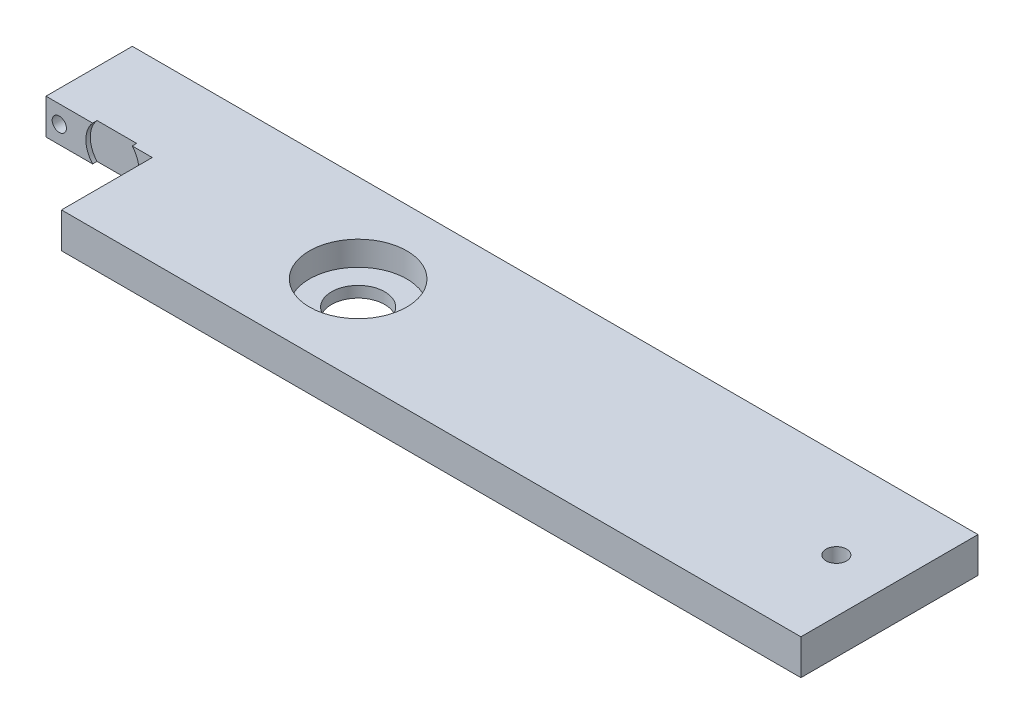
ISO-10303-21;
HEADER;
FILE_DESCRIPTION(('STEP AP214'),'2;1');
FILE_NAME('part.step','',(''),(''),'','','');
FILE_SCHEMA(('AUTOMOTIVE_DESIGN { 1 0 10303 214 1 1 1 1 }'));
ENDSEC;
DATA;
#1=APPLICATION_CONTEXT('core data for automotive mechanical design processes');
#2=APPLICATION_PROTOCOL_DEFINITION('international standard','automotive_design',2000,#1);
#3=PRODUCT_CONTEXT('',#1,'mechanical');
#4=PRODUCT('Part','Part','',(#3));
#5=PRODUCT_RELATED_PRODUCT_CATEGORY('part','',(#4));
#6=PRODUCT_DEFINITION_FORMATION('','',#4);
#7=PRODUCT_DEFINITION_CONTEXT('part definition',#1,'design');
#8=PRODUCT_DEFINITION('design','',#6,#7);
#9=PRODUCT_DEFINITION_SHAPE('','',#8);
#10=(LENGTH_UNIT() NAMED_UNIT(*) SI_UNIT(.MILLI.,.METRE.));
#11=(NAMED_UNIT(*) PLANE_ANGLE_UNIT() SI_UNIT($,.RADIAN.));
#12=(NAMED_UNIT(*) SI_UNIT($,.STERADIAN.) SOLID_ANGLE_UNIT());
#13=UNCERTAINTY_MEASURE_WITH_UNIT(LENGTH_MEASURE(1.E-05),#10,'distance_accuracy_value','');
#14=(GEOMETRIC_REPRESENTATION_CONTEXT(3) GLOBAL_UNCERTAINTY_ASSIGNED_CONTEXT((#13)) GLOBAL_UNIT_ASSIGNED_CONTEXT((#10,
#11,#12)) REPRESENTATION_CONTEXT('',''));
#15=CARTESIAN_POINT('',(0.,0.,0.));
#16=DIRECTION('',(0.,0.,1.));
#17=DIRECTION('',(1.,0.,0.));
#18=AXIS2_PLACEMENT_3D('',#15,#16,#17);
#19=CARTESIAN_POINT('',(-74.6124999999999,12.7,-0.79375));
#20=DIRECTION('',(0.,0.,-1.));
#21=DIRECTION('',(-1.,0.,0.));
#22=AXIS2_PLACEMENT_3D('',#19,#20,#21);
#23=PLANE('',#22);
#24=DIRECTION('',(1.,0.,0.));
#25=VECTOR('',#24,1.);
#26=CARTESIAN_POINT('',(-112.7125,12.7,-0.79375));
#27=LINE('',#26,#25);
#28=CARTESIAN_POINT('',(-81.800484171438,12.7,-0.79375));
#29=VERTEX_POINT('',#28);
#30=CARTESIAN_POINT('',(-74.6124999999999,12.7,-0.79375));
#31=VERTEX_POINT('',#30);
#32=EDGE_CURVE('E107',#29,#31,#27,.T.);
#33=ORIENTED_EDGE('',*,*,#32,.F.);
#34=CARTESIAN_POINT('',(-88.8999999999999,6.35,-0.79375));
#35=DIRECTION('',(0.,0.,1.));
#36=DIRECTION('',(1.,0.,0.));
#37=AXIS2_PLACEMENT_3D('',#34,#35,#36);
#38=CIRCLE('',#37,9.52500000000001);
#39=CARTESIAN_POINT('',(-81.800484171438,0.,-0.79375));
#40=VERTEX_POINT('',#39);
#41=EDGE_CURVE('E177',#40,#29,#38,.T.);
#42=ORIENTED_EDGE('',*,*,#41,.F.);
#43=DIRECTION('',(1.,0.,0.));
#44=VECTOR('',#43,1.);
#45=CARTESIAN_POINT('',(-74.6124999999999,0.,-0.79375));
#46=LINE('',#45,#44);
#47=CARTESIAN_POINT('',(-74.6124999999999,0.,-0.79375));
#48=VERTEX_POINT('',#47);
#49=EDGE_CURVE('E127',#40,#48,#46,.T.);
#50=ORIENTED_EDGE('',*,*,#49,.T.);
#51=DIRECTION('',(0.,-1.,0.));
#52=VECTOR('',#51,1.);
#53=CARTESIAN_POINT('',(-74.6124999999999,12.7,-0.79375));
#54=LINE('',#53,#52);
#55=EDGE_CURVE('E125',#31,#48,#54,.T.);
#56=ORIENTED_EDGE('',*,*,#55,.F.);
#57=EDGE_LOOP('',(#33,#42,#50,#56));
#58=FACE_BOUND('',#57,.T.);
#59=ADVANCED_FACE('F37',(#58),#23,.F.);
#60=CARTESIAN_POINT('',(190.5,12.7,-31.75));
#61=DIRECTION('',(-1.,0.,0.));
#62=DIRECTION('',(0.,0.,1.));
#63=AXIS2_PLACEMENT_3D('',#60,#61,#62);
#64=PLANE('',#63);
#65=DIRECTION('',(0.,0.,-1.));
#66=VECTOR('',#65,1.);
#67=CARTESIAN_POINT('',(190.5,0.,-31.75));
#68=LINE('',#67,#66);
#69=CARTESIAN_POINT('',(190.5,0.,31.75));
#70=VERTEX_POINT('',#69);
#71=CARTESIAN_POINT('',(190.5,0.,-31.75));
#72=VERTEX_POINT('',#71);
#73=EDGE_CURVE('E140',#70,#72,#68,.T.);
#74=ORIENTED_EDGE('',*,*,#73,.T.);
#75=DIRECTION('',(0.,-1.,0.));
#76=VECTOR('',#75,1.);
#77=CARTESIAN_POINT('',(190.5,12.7,-31.75));
#78=LINE('',#77,#76);
#79=CARTESIAN_POINT('',(190.5,12.7,-31.75));
#80=VERTEX_POINT('',#79);
#81=EDGE_CURVE('E163',#80,#72,#78,.T.);
#82=ORIENTED_EDGE('',*,*,#81,.F.);
#83=DIRECTION('',(0.,0.,-1.));
#84=VECTOR('',#83,1.);
#85=CARTESIAN_POINT('',(190.5,12.7,-31.75));
#86=LINE('',#85,#84);
#87=CARTESIAN_POINT('',(190.5,12.7,31.75));
#88=VERTEX_POINT('',#87);
#89=EDGE_CURVE('E155',#88,#80,#86,.T.);
#90=ORIENTED_EDGE('',*,*,#89,.F.);
#91=DIRECTION('',(0.,-1.,0.));
#92=VECTOR('',#91,1.);
#93=CARTESIAN_POINT('',(190.5,12.7,31.75));
#94=LINE('',#93,#92);
#95=EDGE_CURVE('E135',#88,#70,#94,.T.);
#96=ORIENTED_EDGE('',*,*,#95,.T.);
#97=EDGE_LOOP('',(#74,#82,#90,#96));
#98=FACE_BOUND('',#97,.T.);
#99=ADVANCED_FACE('F39',(#98),#64,.F.);
#100=CARTESIAN_POINT('',(-112.7125,12.7,-31.75));
#101=DIRECTION('',(0.,0.,1.));
#102=DIRECTION('',(1.,0.,0.));
#103=AXIS2_PLACEMENT_3D('',#100,#101,#102);
#104=PLANE('',#103);
#105=CARTESIAN_POINT('',(-107.95,6.35,-31.75));
#106=DIRECTION('',(0.,0.,-1.));
#107=DIRECTION('',(-1.,0.,0.));
#108=AXIS2_PLACEMENT_3D('',#105,#106,#107);
#109=CIRCLE('',#108,2.55269999999999);
#110=CARTESIAN_POINT('',(-110.5027,6.35,-31.75));
#111=VERTEX_POINT('',#110);
#112=EDGE_CURVE('E199',#111,#111,#109,.T.);
#113=ORIENTED_EDGE('',*,*,#112,.F.);
#114=EDGE_LOOP('',(#113));
#115=FACE_BOUND('',#114,.T.);
#116=DIRECTION('',(-1.,0.,0.));
#117=VECTOR('',#116,1.);
#118=CARTESIAN_POINT('',(-112.7125,0.,-31.75));
#119=LINE('',#118,#117);
#120=CARTESIAN_POINT('',(-112.7125,0.,-31.75));
#121=VERTEX_POINT('',#120);
#122=EDGE_CURVE('E143',#72,#121,#119,.T.);
#123=ORIENTED_EDGE('',*,*,#122,.T.);
#124=DIRECTION('',(0.,-1.,0.));
#125=VECTOR('',#124,1.);
#126=CARTESIAN_POINT('',(-112.7125,12.7,-31.75));
#127=LINE('',#126,#125);
#128=CARTESIAN_POINT('',(-112.7125,12.7,-31.75));
#129=VERTEX_POINT('',#128);
#130=EDGE_CURVE('E160',#129,#121,#127,.T.);
#131=ORIENTED_EDGE('',*,*,#130,.F.);
#132=DIRECTION('',(-1.,0.,0.));
#133=VECTOR('',#132,1.);
#134=CARTESIAN_POINT('',(-112.7125,12.7,-31.75));
#135=LINE('',#134,#133);
#136=EDGE_CURVE('E97',#80,#129,#135,.T.);
#137=ORIENTED_EDGE('',*,*,#136,.F.);
#138=ORIENTED_EDGE('',*,*,#81,.T.);
#139=EDGE_LOOP('',(#123,#131,#137,#138));
#140=FACE_BOUND('',#139,.T.);
#141=ADVANCED_FACE('F233',(#115,#140),#104,.F.);
#142=CARTESIAN_POINT('',(-112.7125,12.7,-31.75));
#143=DIRECTION('',(1.,0.,0.));
#144=DIRECTION('',(0.,0.,-1.));
#145=AXIS2_PLACEMENT_3D('',#142,#143,#144);
#146=PLANE('',#145);
#147=DIRECTION('',(0.,0.,1.));
#148=VECTOR('',#147,1.);
#149=CARTESIAN_POINT('',(-112.7125,0.,-31.75));
#150=LINE('',#149,#148);
#151=CARTESIAN_POINT('',(-112.7125,0.,-0.79375));
#152=VERTEX_POINT('',#151);
#153=EDGE_CURVE('E146',#121,#152,#150,.T.);
#154=ORIENTED_EDGE('',*,*,#153,.T.);
#155=DIRECTION('',(0.,-1.,0.));
#156=VECTOR('',#155,1.);
#157=CARTESIAN_POINT('',(-112.7125,12.7,-0.79375));
#158=LINE('',#157,#156);
#159=CARTESIAN_POINT('',(-112.7125,12.7,-0.79375));
#160=VERTEX_POINT('',#159);
#161=EDGE_CURVE('E130',#160,#152,#158,.T.);
#162=ORIENTED_EDGE('',*,*,#161,.F.);
#163=DIRECTION('',(0.,0.,1.));
#164=VECTOR('',#163,1.);
#165=CARTESIAN_POINT('',(-112.7125,12.7,-31.75));
#166=LINE('',#165,#164);
#167=EDGE_CURVE('E122',#129,#160,#166,.T.);
#168=ORIENTED_EDGE('',*,*,#167,.F.);
#169=ORIENTED_EDGE('',*,*,#130,.T.);
#170=EDGE_LOOP('',(#154,#162,#168,#169));
#171=FACE_BOUND('',#170,.T.);
#172=ADVANCED_FACE('F222',(#171),#146,.F.);
#173=CARTESIAN_POINT('',(-107.95,6.35,-0.793749999999999));
#174=DIRECTION('',(0.,0.,-1.));
#175=DIRECTION('',(-1.,0.,0.));
#176=AXIS2_PLACEMENT_3D('',#173,#174,#175);
#177=CIRCLE('',#176,2.55269999999999);
#178=CARTESIAN_POINT('',(-110.5027,6.35,-0.793749999999999));
#179=VERTEX_POINT('',#178);
#180=EDGE_CURVE('E202',#179,#179,#177,.T.);
#181=ORIENTED_EDGE('',*,*,#180,.T.);
#182=EDGE_LOOP('',(#181));
#183=FACE_BOUND('',#182,.T.);
#184=CARTESIAN_POINT('',(-95.9995158285617,0.,-0.79375));
#185=VERTEX_POINT('',#184);
#186=EDGE_CURVE('E149',#152,#185,#46,.T.);
#187=ORIENTED_EDGE('',*,*,#186,.T.);
#188=CARTESIAN_POINT('',(-95.9995158285617,12.7,-0.79375));
#189=VERTEX_POINT('',#188);
#190=EDGE_CURVE('E183',#189,#185,#38,.T.);
#191=ORIENTED_EDGE('',*,*,#190,.F.);
#192=EDGE_CURVE('E121',#160,#189,#27,.T.);
#193=ORIENTED_EDGE('',*,*,#192,.F.);
#194=ORIENTED_EDGE('',*,*,#161,.T.);
#195=EDGE_LOOP('',(#187,#191,#193,#194));
#196=FACE_BOUND('',#195,.T.);
#197=ADVANCED_FACE('F226',(#183,#196),#23,.F.);
#198=CARTESIAN_POINT('',(-74.6124999999999,12.7,31.75));
#199=DIRECTION('',(1.,0.,0.));
#200=DIRECTION('',(0.,0.,-1.));
#201=AXIS2_PLACEMENT_3D('',#198,#199,#200);
#202=PLANE('',#201);
#203=DIRECTION('',(0.,0.,1.));
#204=VECTOR('',#203,1.);
#205=CARTESIAN_POINT('',(-74.6124999999999,0.,31.75));
#206=LINE('',#205,#204);
#207=CARTESIAN_POINT('',(-74.6124999999999,0.,31.75));
#208=VERTEX_POINT('',#207);
#209=EDGE_CURVE('E152',#48,#208,#206,.T.);
#210=ORIENTED_EDGE('',*,*,#209,.T.);
#211=DIRECTION('',(0.,-1.,0.));
#212=VECTOR('',#211,1.);
#213=CARTESIAN_POINT('',(-74.6124999999999,12.7,31.75));
#214=LINE('',#213,#212);
#215=CARTESIAN_POINT('',(-74.6124999999999,12.7,31.75));
#216=VERTEX_POINT('',#215);
#217=EDGE_CURVE('E131',#216,#208,#214,.T.);
#218=ORIENTED_EDGE('',*,*,#217,.F.);
#219=DIRECTION('',(0.,0.,1.));
#220=VECTOR('',#219,1.);
#221=CARTESIAN_POINT('',(-74.6124999999999,12.7,31.75));
#222=LINE('',#221,#220);
#223=EDGE_CURVE('E113',#31,#216,#222,.T.);
#224=ORIENTED_EDGE('',*,*,#223,.F.);
#225=ORIENTED_EDGE('',*,*,#55,.T.);
#226=EDGE_LOOP('',(#210,#218,#224,#225));
#227=FACE_BOUND('',#226,.T.);
#228=ADVANCED_FACE('F133',(#227),#202,.F.);
#229=CARTESIAN_POINT('',(-74.6124999999999,12.7,31.75));
#230=DIRECTION('',(0.,0.,-1.));
#231=DIRECTION('',(-1.,0.,0.));
#232=AXIS2_PLACEMENT_3D('',#229,#230,#231);
#233=PLANE('',#232);
#234=DIRECTION('',(1.,0.,0.));
#235=VECTOR('',#234,1.);
#236=CARTESIAN_POINT('',(-74.6124999999999,0.,31.75));
#237=LINE('',#236,#235);
#238=EDGE_CURVE('E88',#208,#70,#237,.T.);
#239=ORIENTED_EDGE('',*,*,#238,.T.);
#240=ORIENTED_EDGE('',*,*,#95,.F.);
#241=DIRECTION('',(1.,0.,0.));
#242=VECTOR('',#241,1.);
#243=CARTESIAN_POINT('',(-74.6124999999999,12.7,31.75));
#244=LINE('',#243,#242);
#245=EDGE_CURVE('E61',#216,#88,#244,.T.);
#246=ORIENTED_EDGE('',*,*,#245,.F.);
#247=ORIENTED_EDGE('',*,*,#217,.T.);
#248=EDGE_LOOP('',(#239,#240,#246,#247));
#249=FACE_BOUND('',#248,.T.);
#250=ADVANCED_FACE('F236',(#249),#233,.F.);
#251=CARTESIAN_POINT('',(190.5,12.7,31.75));
#252=DIRECTION('',(0.,1.,0.));
#253=DIRECTION('',(0.,0.,1.));
#254=AXIS2_PLACEMENT_3D('',#251,#252,#253);
#255=PLANE('',#254);
#256=DIRECTION('',(0.,0.,1.));
#257=VECTOR('',#256,1.);
#258=CARTESIAN_POINT('',(-95.9995158285617,12.7,-2.38125));
#259=LINE('',#258,#257);
#260=CARTESIAN_POINT('',(-95.9995158285617,12.7,-2.38125));
#261=VERTEX_POINT('',#260);
#262=EDGE_CURVE('E196',#261,#189,#259,.T.);
#263=ORIENTED_EDGE('',*,*,#262,.F.);
#264=DIRECTION('',(1.,0.,0.));
#265=VECTOR('',#264,1.);
#266=CARTESIAN_POINT('',(190.5,12.7,-2.38125));
#267=LINE('',#266,#265);
#268=CARTESIAN_POINT('',(-81.800484171438,12.7,-2.38125));
#269=VERTEX_POINT('',#268);
#270=EDGE_CURVE('E193',#261,#269,#267,.T.);
#271=ORIENTED_EDGE('',*,*,#270,.T.);
#272=DIRECTION('',(0.,0.,1.));
#273=VECTOR('',#272,1.);
#274=CARTESIAN_POINT('',(-81.800484171438,12.7,-2.38125));
#275=LINE('',#274,#273);
#276=EDGE_CURVE('E118',#29,#269,#275,.F.);
#277=ORIENTED_EDGE('',*,*,#276,.F.);
#278=ORIENTED_EDGE('',*,*,#32,.T.);
#279=ORIENTED_EDGE('',*,*,#223,.T.);
#280=ORIENTED_EDGE('',*,*,#245,.T.);
#281=ORIENTED_EDGE('',*,*,#89,.T.);
#282=ORIENTED_EDGE('',*,*,#136,.T.);
#283=ORIENTED_EDGE('',*,*,#167,.T.);
#284=ORIENTED_EDGE('',*,*,#192,.T.);
#285=EDGE_LOOP('',(#263,#271,#277,#278,#279,#280,#281,#282,#283,#284));
#286=FACE_BOUND('',#285,.T.);
#287=CARTESIAN_POINT('',(171.45,12.7,0.));
#288=DIRECTION('',(0.,1.,0.));
#289=DIRECTION('',(0.,0.,1.));
#290=AXIS2_PLACEMENT_3D('',#287,#288,#289);
#291=CIRCLE('',#290,3.683);
#292=CARTESIAN_POINT('',(171.45,12.7,3.683));
#293=VERTEX_POINT('',#292);
#294=EDGE_CURVE('E205',#293,#293,#291,.T.);
#295=ORIENTED_EDGE('',*,*,#294,.F.);
#296=EDGE_LOOP('',(#295));
#297=FACE_BOUND('',#296,.T.);
#298=CARTESIAN_POINT('',(0.,12.7,0.));
#299=DIRECTION('',(0.,1.,0.));
#300=DIRECTION('',(0.,0.,1.));
#301=AXIS2_PLACEMENT_3D('',#298,#299,#300);
#302=CIRCLE('',#301,17.4625);
#303=CARTESIAN_POINT('',(0.,12.7,17.4625));
#304=VERTEX_POINT('',#303);
#305=EDGE_CURVE('E209',#304,#304,#302,.T.);
#306=ORIENTED_EDGE('',*,*,#305,.F.);
#307=EDGE_LOOP('',(#306));
#308=FACE_BOUND('',#307,.T.);
#309=ADVANCED_FACE('F110',(#286,#297,#308),#255,.T.);
#310=CARTESIAN_POINT('',(190.5,0.,31.75));
#311=DIRECTION('',(0.,1.,0.));
#312=DIRECTION('',(0.,0.,1.));
#313=AXIS2_PLACEMENT_3D('',#310,#311,#312);
#314=PLANE('',#313);
#315=CARTESIAN_POINT('',(0.,0.,0.));
#316=DIRECTION('',(0.,1.,0.));
#317=DIRECTION('',(0.,0.,1.));
#318=AXIS2_PLACEMENT_3D('',#315,#316,#317);
#319=CIRCLE('',#318,9.525);
#320=CARTESIAN_POINT('',(0.,0.,9.525));
#321=VERTEX_POINT('',#320);
#322=EDGE_CURVE('E184',#321,#321,#319,.T.);
#323=ORIENTED_EDGE('',*,*,#322,.T.);
#324=EDGE_LOOP('',(#323));
#325=FACE_BOUND('',#324,.T.);
#326=CARTESIAN_POINT('',(171.45,0.,0.));
#327=DIRECTION('',(0.,1.,0.));
#328=DIRECTION('',(0.,0.,1.));
#329=AXIS2_PLACEMENT_3D('',#326,#327,#328);
#330=CIRCLE('',#329,3.683);
#331=CARTESIAN_POINT('',(171.45,0.,3.683));
#332=VERTEX_POINT('',#331);
#333=EDGE_CURVE('E206',#332,#332,#330,.T.);
#334=ORIENTED_EDGE('',*,*,#333,.T.);
#335=EDGE_LOOP('',(#334));
#336=FACE_BOUND('',#335,.T.);
#337=DIRECTION('',(1.,0.,0.));
#338=VECTOR('',#337,1.);
#339=CARTESIAN_POINT('',(190.5,0.,-2.38125));
#340=LINE('',#339,#338);
#341=CARTESIAN_POINT('',(-95.9995158285617,0.,-2.38125));
#342=VERTEX_POINT('',#341);
#343=CARTESIAN_POINT('',(-81.800484171438,0.,-2.38125));
#344=VERTEX_POINT('',#343);
#345=EDGE_CURVE('E165',#342,#344,#340,.T.);
#346=ORIENTED_EDGE('',*,*,#345,.F.);
#347=DIRECTION('',(0.,0.,1.));
#348=VECTOR('',#347,1.);
#349=CARTESIAN_POINT('',(-95.9995158285617,0.,-2.38125));
#350=LINE('',#349,#348);
#351=EDGE_CURVE('E11',#342,#185,#350,.T.);
#352=ORIENTED_EDGE('',*,*,#351,.T.);
#353=ORIENTED_EDGE('',*,*,#186,.F.);
#354=ORIENTED_EDGE('',*,*,#153,.F.);
#355=ORIENTED_EDGE('',*,*,#122,.F.);
#356=ORIENTED_EDGE('',*,*,#73,.F.);
#357=ORIENTED_EDGE('',*,*,#238,.F.);
#358=ORIENTED_EDGE('',*,*,#209,.F.);
#359=ORIENTED_EDGE('',*,*,#49,.F.);
#360=DIRECTION('',(0.,0.,1.));
#361=VECTOR('',#360,1.);
#362=CARTESIAN_POINT('',(-81.800484171438,0.,-2.38125));
#363=LINE('',#362,#361);
#364=EDGE_CURVE('E45',#40,#344,#363,.F.);
#365=ORIENTED_EDGE('',*,*,#364,.T.);
#366=EDGE_LOOP('',(#346,#352,#353,#354,#355,#356,#357,#358,#359,#365));
#367=FACE_BOUND('',#366,.T.);
#368=ADVANCED_FACE('F170',(#325,#336,#367),#314,.F.);
#369=CARTESIAN_POINT('',(0.,3.96875,0.));
#370=DIRECTION('',(0.,1.,0.));
#371=DIRECTION('',(0.,0.,1.));
#372=AXIS2_PLACEMENT_3D('',#369,#370,#371);
#373=CYLINDRICAL_SURFACE('',#372,17.4625);
#374=CARTESIAN_POINT('',(0.,3.96875,0.));
#375=DIRECTION('',(0.,1.,0.));
#376=DIRECTION('',(0.,0.,1.));
#377=AXIS2_PLACEMENT_3D('',#374,#375,#376);
#378=CIRCLE('',#377,17.4625);
#379=CARTESIAN_POINT('',(0.,3.96875,17.4625));
#380=VERTEX_POINT('',#379);
#381=EDGE_CURVE('E144',#380,#380,#378,.T.);
#382=ORIENTED_EDGE('',*,*,#381,.F.);
#383=EDGE_LOOP('',(#382));
#384=FACE_BOUND('',#383,.T.);
#385=ORIENTED_EDGE('',*,*,#305,.T.);
#386=EDGE_LOOP('',(#385));
#387=FACE_BOUND('',#386,.T.);
#388=ADVANCED_FACE('F276',(#384,#387),#373,.F.);
#389=CARTESIAN_POINT('',(0.,3.96875,0.));
#390=DIRECTION('',(0.,1.,0.));
#391=DIRECTION('',(0.,0.,1.));
#392=AXIS2_PLACEMENT_3D('',#389,#390,#391);
#393=PLANE('',#392);
#394=CARTESIAN_POINT('',(0.,3.96875,0.));
#395=DIRECTION('',(0.,1.,0.));
#396=DIRECTION('',(0.,0.,1.));
#397=AXIS2_PLACEMENT_3D('',#394,#395,#396);
#398=CIRCLE('',#397,9.525);
#399=CARTESIAN_POINT('',(0.,3.96875,9.525));
#400=VERTEX_POINT('',#399);
#401=EDGE_CURVE('E188',#400,#400,#398,.T.);
#402=ORIENTED_EDGE('',*,*,#401,.F.);
#403=EDGE_LOOP('',(#402));
#404=FACE_BOUND('',#403,.T.);
#405=ORIENTED_EDGE('',*,*,#381,.T.);
#406=EDGE_LOOP('',(#405));
#407=FACE_BOUND('',#406,.T.);
#408=ADVANCED_FACE('F269',(#404,#407),#393,.T.);
#409=CARTESIAN_POINT('',(171.45,0.,0.));
#410=DIRECTION('',(0.,1.,0.));
#411=DIRECTION('',(0.,0.,1.));
#412=AXIS2_PLACEMENT_3D('',#409,#410,#411);
#413=CYLINDRICAL_SURFACE('',#412,3.683);
#414=ORIENTED_EDGE('',*,*,#333,.F.);
#415=EDGE_LOOP('',(#414));
#416=FACE_BOUND('',#415,.T.);
#417=ORIENTED_EDGE('',*,*,#294,.T.);
#418=EDGE_LOOP('',(#417));
#419=FACE_BOUND('',#418,.T.);
#420=ADVANCED_FACE('F261',(#416,#419),#413,.F.);
#421=CARTESIAN_POINT('',(-107.95,6.35,-31.75));
#422=DIRECTION('',(0.,0.,-1.));
#423=DIRECTION('',(-1.,0.,0.));
#424=AXIS2_PLACEMENT_3D('',#421,#422,#423);
#425=CYLINDRICAL_SURFACE('',#424,2.55269999999999);
#426=ORIENTED_EDGE('',*,*,#112,.T.);
#427=EDGE_LOOP('',(#426));
#428=FACE_BOUND('',#427,.T.);
#429=ORIENTED_EDGE('',*,*,#180,.F.);
#430=EDGE_LOOP('',(#429));
#431=FACE_BOUND('',#430,.T.);
#432=ADVANCED_FACE('F259',(#428,#431),#425,.F.);
#433=CARTESIAN_POINT('',(-88.8999999999999,6.35,-2.38125));
#434=DIRECTION('',(0.,0.,1.));
#435=DIRECTION('',(1.,0.,0.));
#436=AXIS2_PLACEMENT_3D('',#433,#434,#435);
#437=CYLINDRICAL_SURFACE('',#436,9.52500000000001);
#438=ORIENTED_EDGE('',*,*,#262,.T.);
#439=ORIENTED_EDGE('',*,*,#190,.T.);
#440=ORIENTED_EDGE('',*,*,#351,.F.);
#441=CARTESIAN_POINT('',(-88.8999999999999,6.35,-2.38125));
#442=DIRECTION('',(0.,0.,1.));
#443=DIRECTION('',(1.,0.,0.));
#444=AXIS2_PLACEMENT_3D('',#441,#442,#443);
#445=CIRCLE('',#444,9.52500000000001);
#446=EDGE_CURVE('E52',#261,#342,#445,.T.);
#447=ORIENTED_EDGE('',*,*,#446,.F.);
#448=EDGE_LOOP('',(#438,#439,#440,#447));
#449=FACE_BOUND('',#448,.T.);
#450=ADVANCED_FACE('F229',(#449),#437,.F.);
#451=ORIENTED_EDGE('',*,*,#276,.T.);
#452=EDGE_CURVE('E179',#344,#269,#445,.T.);
#453=ORIENTED_EDGE('',*,*,#452,.F.);
#454=ORIENTED_EDGE('',*,*,#364,.F.);
#455=ORIENTED_EDGE('',*,*,#41,.T.);
#456=EDGE_LOOP('',(#451,#453,#454,#455));
#457=FACE_BOUND('',#456,.T.);
#458=ADVANCED_FACE('F176',(#457),#437,.F.);
#459=CARTESIAN_POINT('',(-88.8999999999999,6.35,-2.38125));
#460=DIRECTION('',(0.,0.,1.));
#461=DIRECTION('',(1.,0.,0.));
#462=AXIS2_PLACEMENT_3D('',#459,#460,#461);
#463=PLANE('',#462);
#464=ORIENTED_EDGE('',*,*,#446,.T.);
#465=ORIENTED_EDGE('',*,*,#345,.T.);
#466=ORIENTED_EDGE('',*,*,#452,.T.);
#467=ORIENTED_EDGE('',*,*,#270,.F.);
#468=EDGE_LOOP('',(#464,#465,#466,#467));
#469=FACE_BOUND('',#468,.T.);
#470=ADVANCED_FACE('F296',(#469),#463,.T.);
#471=CARTESIAN_POINT('',(0.,0.,0.));
#472=DIRECTION('',(0.,1.,0.));
#473=DIRECTION('',(0.,0.,1.));
#474=AXIS2_PLACEMENT_3D('',#471,#472,#473);
#475=CYLINDRICAL_SURFACE('',#474,9.525);
#476=ORIENTED_EDGE('',*,*,#322,.F.);
#477=EDGE_LOOP('',(#476));
#478=FACE_BOUND('',#477,.T.);
#479=ORIENTED_EDGE('',*,*,#401,.T.);
#480=EDGE_LOOP('',(#479));
#481=FACE_BOUND('',#480,.T.);
#482=ADVANCED_FACE('F293',(#478,#481),#475,.F.);
#483=CLOSED_SHELL('',(#59,#99,#141,#172,#197,#228,#250,#309,#368,#388,#408,#420,#432,#450,#458,
#470,#482));
#484=MANIFOLD_SOLID_BREP('B2',#483);
#485=ADVANCED_BREP_SHAPE_REPRESENTATION('',(#18,#484),#14);
#486=SHAPE_DEFINITION_REPRESENTATION(#9,#485);
ENDSEC;
END-ISO-10303-21;
